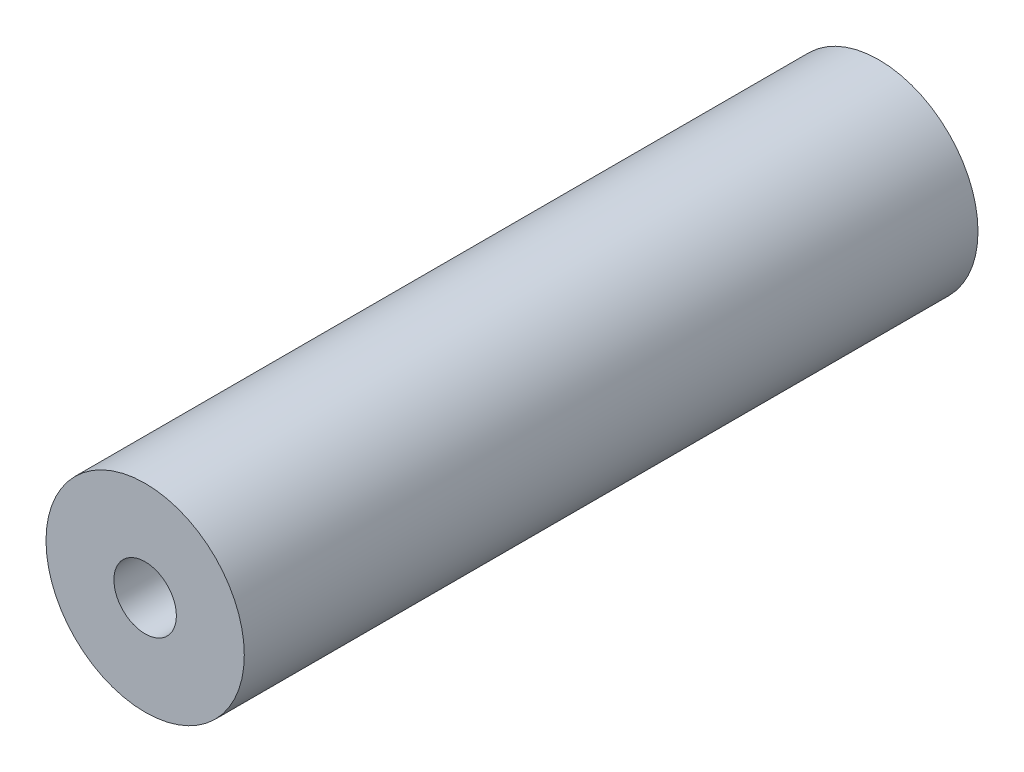
ISO-10303-21;
HEADER;
FILE_DESCRIPTION(('STEP AP214'),'2;1');
FILE_NAME('part.step','',(''),(''),'','','');
FILE_SCHEMA(('AUTOMOTIVE_DESIGN { 1 0 10303 214 1 1 1 1 }'));
ENDSEC;
DATA;
#1=APPLICATION_CONTEXT('core data for automotive mechanical design processes');
#2=APPLICATION_PROTOCOL_DEFINITION('international standard','automotive_design',2000,#1);
#3=PRODUCT_CONTEXT('',#1,'mechanical');
#4=PRODUCT('Part','Part','',(#3));
#5=PRODUCT_RELATED_PRODUCT_CATEGORY('part','',(#4));
#6=PRODUCT_DEFINITION_FORMATION('','',#4);
#7=PRODUCT_DEFINITION_CONTEXT('part definition',#1,'design');
#8=PRODUCT_DEFINITION('design','',#6,#7);
#9=PRODUCT_DEFINITION_SHAPE('','',#8);
#10=(LENGTH_UNIT() NAMED_UNIT(*) SI_UNIT(.MILLI.,.METRE.));
#11=(NAMED_UNIT(*) PLANE_ANGLE_UNIT() SI_UNIT($,.RADIAN.));
#12=(NAMED_UNIT(*) SI_UNIT($,.STERADIAN.) SOLID_ANGLE_UNIT());
#13=UNCERTAINTY_MEASURE_WITH_UNIT(LENGTH_MEASURE(1.E-05),#10,'distance_accuracy_value','');
#14=(GEOMETRIC_REPRESENTATION_CONTEXT(3) GLOBAL_UNCERTAINTY_ASSIGNED_CONTEXT((#13)) GLOBAL_UNIT_ASSIGNED_CONTEXT((#10,
#11,#12)) REPRESENTATION_CONTEXT('',''));
#15=CARTESIAN_POINT('',(0.,0.,0.));
#16=DIRECTION('',(0.,0.,1.));
#17=DIRECTION('',(1.,0.,0.));
#18=AXIS2_PLACEMENT_3D('',#15,#16,#17);
#19=CARTESIAN_POINT('',(0.,0.,37.));
#20=DIRECTION('',(0.,0.,-1.));
#21=DIRECTION('',(-1.,0.,0.));
#22=AXIS2_PLACEMENT_3D('',#19,#20,#21);
#23=CYLINDRICAL_SURFACE('',#22,5.);
#24=CARTESIAN_POINT('',(0.,0.,37.));
#25=DIRECTION('',(0.,0.,1.));
#26=DIRECTION('',(1.,0.,0.));
#27=AXIS2_PLACEMENT_3D('',#24,#25,#26);
#28=CIRCLE('',#27,5.);
#29=CARTESIAN_POINT('',(5.,0.,37.));
#30=VERTEX_POINT('',#29);
#31=EDGE_CURVE('E10',#30,#30,#28,.T.);
#32=ORIENTED_EDGE('',*,*,#31,.F.);
#33=EDGE_LOOP('',(#32));
#34=FACE_BOUND('',#33,.T.);
#35=CARTESIAN_POINT('',(0.,0.,0.));
#36=DIRECTION('',(0.,0.,1.));
#37=DIRECTION('',(1.,0.,0.));
#38=AXIS2_PLACEMENT_3D('',#35,#36,#37);
#39=CIRCLE('',#38,5.);
#40=CARTESIAN_POINT('',(5.,0.,0.));
#41=VERTEX_POINT('',#40);
#42=EDGE_CURVE('E38',#41,#41,#39,.T.);
#43=ORIENTED_EDGE('',*,*,#42,.T.);
#44=EDGE_LOOP('',(#43));
#45=FACE_BOUND('',#44,.T.);
#46=ADVANCED_FACE('F35',(#34,#45),#23,.T.);
#47=CARTESIAN_POINT('',(0.,0.,37.));
#48=DIRECTION('',(0.,0.,1.));
#49=DIRECTION('',(1.,0.,0.));
#50=AXIS2_PLACEMENT_3D('',#47,#48,#49);
#51=PLANE('',#50);
#52=CARTESIAN_POINT('',(0.,0.,37.));
#53=DIRECTION('',(0.,0.,1.));
#54=DIRECTION('',(1.,0.,0.));
#55=AXIS2_PLACEMENT_3D('',#52,#53,#54);
#56=CIRCLE('',#55,1.57499999999999);
#57=CARTESIAN_POINT('',(1.57499999999999,0.,37.));
#58=VERTEX_POINT('',#57);
#59=EDGE_CURVE('E49',#58,#58,#56,.T.);
#60=ORIENTED_EDGE('',*,*,#59,.F.);
#61=EDGE_LOOP('',(#60));
#62=FACE_BOUND('',#61,.T.);
#63=ORIENTED_EDGE('',*,*,#31,.T.);
#64=EDGE_LOOP('',(#63));
#65=FACE_BOUND('',#64,.T.);
#66=ADVANCED_FACE('F55',(#62,#65),#51,.T.);
#67=CARTESIAN_POINT('',(0.,0.,0.));
#68=DIRECTION('',(0.,0.,1.));
#69=DIRECTION('',(1.,0.,0.));
#70=AXIS2_PLACEMENT_3D('',#67,#68,#69);
#71=PLANE('',#70);
#72=CARTESIAN_POINT('',(0.,0.,0.));
#73=DIRECTION('',(0.,0.,1.));
#74=DIRECTION('',(1.,0.,0.));
#75=AXIS2_PLACEMENT_3D('',#72,#73,#74);
#76=CIRCLE('',#75,1.57499999999999);
#77=CARTESIAN_POINT('',(1.57499999999999,0.,0.));
#78=VERTEX_POINT('',#77);
#79=EDGE_CURVE('E45',#78,#78,#76,.T.);
#80=ORIENTED_EDGE('',*,*,#79,.T.);
#81=EDGE_LOOP('',(#80));
#82=FACE_BOUND('',#81,.T.);
#83=ORIENTED_EDGE('',*,*,#42,.F.);
#84=EDGE_LOOP('',(#83));
#85=FACE_BOUND('',#84,.T.);
#86=ADVANCED_FACE('F57',(#82,#85),#71,.F.);
#87=CARTESIAN_POINT('',(0.,0.,37.));
#88=DIRECTION('',(0.,0.,1.));
#89=DIRECTION('',(1.,0.,0.));
#90=AXIS2_PLACEMENT_3D('',#87,#88,#89);
#91=CYLINDRICAL_SURFACE('',#90,1.57499999999999);
#92=ORIENTED_EDGE('',*,*,#79,.F.);
#93=EDGE_LOOP('',(#92));
#94=FACE_BOUND('',#93,.T.);
#95=ORIENTED_EDGE('',*,*,#59,.T.);
#96=EDGE_LOOP('',(#95));
#97=FACE_BOUND('',#96,.T.);
#98=ADVANCED_FACE('F53',(#94,#97),#91,.F.);
#99=CLOSED_SHELL('',(#46,#66,#86,#98));
#100=MANIFOLD_SOLID_BREP('B2',#99);
#101=ADVANCED_BREP_SHAPE_REPRESENTATION('',(#18,#100),#14);
#102=SHAPE_DEFINITION_REPRESENTATION(#9,#101);
ENDSEC;
END-ISO-10303-21;
